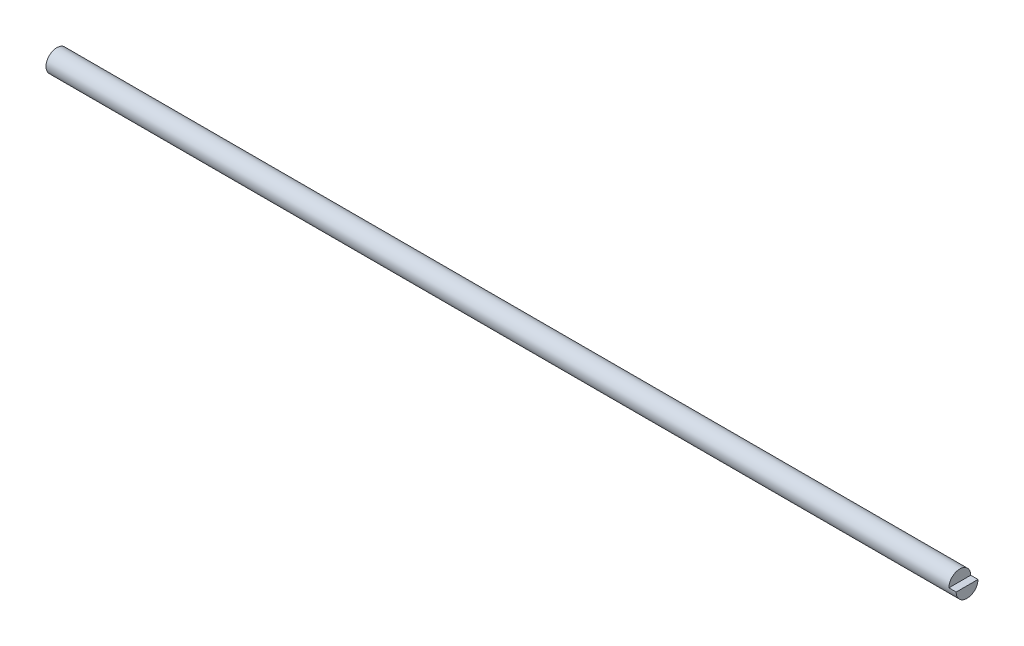
ISO-10303-21;
HEADER;
FILE_DESCRIPTION(('STEP AP214'),'2;1');
FILE_NAME('part.step','',(''),(''),'','','');
FILE_SCHEMA(('AUTOMOTIVE_DESIGN { 1 0 10303 214 1 1 1 1 }'));
ENDSEC;
DATA;
#1=APPLICATION_CONTEXT('core data for automotive mechanical design processes');
#2=APPLICATION_PROTOCOL_DEFINITION('international standard','automotive_design',2000,#1);
#3=PRODUCT_CONTEXT('',#1,'mechanical');
#4=PRODUCT('Part','Part','',(#3));
#5=PRODUCT_RELATED_PRODUCT_CATEGORY('part','',(#4));
#6=PRODUCT_DEFINITION_FORMATION('','',#4);
#7=PRODUCT_DEFINITION_CONTEXT('part definition',#1,'design');
#8=PRODUCT_DEFINITION('design','',#6,#7);
#9=PRODUCT_DEFINITION_SHAPE('','',#8);
#10=(LENGTH_UNIT() NAMED_UNIT(*) SI_UNIT(.MILLI.,.METRE.));
#11=(NAMED_UNIT(*) PLANE_ANGLE_UNIT() SI_UNIT($,.RADIAN.));
#12=(NAMED_UNIT(*) SI_UNIT($,.STERADIAN.) SOLID_ANGLE_UNIT());
#13=UNCERTAINTY_MEASURE_WITH_UNIT(LENGTH_MEASURE(1.E-05),#10,'distance_accuracy_value','');
#14=(GEOMETRIC_REPRESENTATION_CONTEXT(3) GLOBAL_UNCERTAINTY_ASSIGNED_CONTEXT((#13)) GLOBAL_UNIT_ASSIGNED_CONTEXT((#10,
#11,#12)) REPRESENTATION_CONTEXT('',''));
#15=CARTESIAN_POINT('',(0.,0.,0.));
#16=DIRECTION('',(0.,0.,1.));
#17=DIRECTION('',(1.,0.,0.));
#18=AXIS2_PLACEMENT_3D('',#15,#16,#17);
#19=CARTESIAN_POINT('',(317.5,0.,0.));
#20=DIRECTION('',(-1.,0.,0.));
#21=DIRECTION('',(0.,0.,1.));
#22=AXIS2_PLACEMENT_3D('',#19,#20,#21);
#23=CYLINDRICAL_SURFACE('',#22,3.81);
#24=CARTESIAN_POINT('',(0.,0.,0.));
#25=DIRECTION('',(1.,0.,0.));
#26=DIRECTION('',(0.,0.,-1.));
#27=AXIS2_PLACEMENT_3D('',#24,#25,#26);
#28=CIRCLE('',#27,3.81);
#29=CARTESIAN_POINT('',(0.,0.,-3.81));
#30=VERTEX_POINT('',#29);
#31=EDGE_CURVE('E38',#30,#30,#28,.T.);
#32=ORIENTED_EDGE('',*,*,#31,.T.);
#33=EDGE_LOOP('',(#32));
#34=FACE_BOUND('',#33,.T.);
#35=DIRECTION('',(1.,0.,0.));
#36=VECTOR('',#35,1.);
#37=CARTESIAN_POINT('',(314.96,0.,-3.81));
#38=LINE('',#37,#36);
#39=CARTESIAN_POINT('',(314.96,0.,-3.81));
#40=VERTEX_POINT('',#39);
#41=CARTESIAN_POINT('',(317.5,0.,-3.81));
#42=VERTEX_POINT('',#41);
#43=EDGE_CURVE('E62',#40,#42,#38,.T.);
#44=ORIENTED_EDGE('',*,*,#43,.T.);
#45=CARTESIAN_POINT('',(317.5,0.,0.));
#46=DIRECTION('',(1.,0.,0.));
#47=DIRECTION('',(0.,0.,-1.));
#48=AXIS2_PLACEMENT_3D('',#45,#46,#47);
#49=CIRCLE('',#48,3.81);
#50=CARTESIAN_POINT('',(317.5,2.09554595897973E-12,3.81));
#51=VERTEX_POINT('',#50);
#52=EDGE_CURVE('E11',#51,#42,#49,.T.);
#53=ORIENTED_EDGE('',*,*,#52,.F.);
#54=DIRECTION('',(1.,0.,0.));
#55=VECTOR('',#54,1.);
#56=CARTESIAN_POINT('',(314.96,2.09554595897973E-12,3.81));
#57=LINE('',#56,#55);
#58=CARTESIAN_POINT('',(314.96,2.09554595897973E-12,3.81));
#59=VERTEX_POINT('',#58);
#60=EDGE_CURVE('E49',#59,#51,#57,.T.);
#61=ORIENTED_EDGE('',*,*,#60,.F.);
#62=CARTESIAN_POINT('',(314.96,0.,0.));
#63=DIRECTION('',(1.,0.,0.));
#64=DIRECTION('',(0.,0.,-1.));
#65=AXIS2_PLACEMENT_3D('',#62,#63,#64);
#66=CIRCLE('',#65,3.81);
#67=EDGE_CURVE('E68',#40,#59,#66,.T.);
#68=ORIENTED_EDGE('',*,*,#67,.F.);
#69=EDGE_LOOP('',(#44,#53,#61,#68));
#70=FACE_BOUND('',#69,.T.);
#71=ADVANCED_FACE('F35',(#34,#70),#23,.T.);
#72=CARTESIAN_POINT('',(317.5,0.,0.));
#73=DIRECTION('',(1.,0.,0.));
#74=DIRECTION('',(0.,0.,-1.));
#75=AXIS2_PLACEMENT_3D('',#72,#73,#74);
#76=PLANE('',#75);
#77=ORIENTED_EDGE('',*,*,#52,.T.);
#78=DIRECTION('',(0.,5.50012062724339E-13,1.));
#79=VECTOR('',#78,1.);
#80=CARTESIAN_POINT('',(317.5,0.,0.));
#81=LINE('',#80,#79);
#82=EDGE_CURVE('E59',#42,#51,#81,.T.);
#83=ORIENTED_EDGE('',*,*,#82,.T.);
#84=EDGE_LOOP('',(#77,#83));
#85=FACE_BOUND('',#84,.T.);
#86=ADVANCED_FACE('F70',(#85),#76,.T.);
#87=CARTESIAN_POINT('',(0.,0.,0.));
#88=DIRECTION('',(1.,0.,0.));
#89=DIRECTION('',(0.,0.,-1.));
#90=AXIS2_PLACEMENT_3D('',#87,#88,#89);
#91=PLANE('',#90);
#92=ORIENTED_EDGE('',*,*,#31,.F.);
#93=EDGE_LOOP('',(#92));
#94=FACE_BOUND('',#93,.T.);
#95=ADVANCED_FACE('F72',(#94),#91,.F.);
#96=CARTESIAN_POINT('',(314.96,0.,0.));
#97=DIRECTION('',(0.,1.,-5.50012062724339E-13));
#98=DIRECTION('',(0.,5.50012062724339E-13,1.));
#99=AXIS2_PLACEMENT_3D('',#96,#97,#98);
#100=PLANE('',#99);
#101=ORIENTED_EDGE('',*,*,#82,.F.);
#102=ORIENTED_EDGE('',*,*,#43,.F.);
#103=DIRECTION('',(0.,5.50012062724339E-13,1.));
#104=VECTOR('',#103,1.);
#105=CARTESIAN_POINT('',(314.96,0.,0.));
#106=LINE('',#105,#104);
#107=EDGE_CURVE('E55',#40,#59,#106,.T.);
#108=ORIENTED_EDGE('',*,*,#107,.T.);
#109=ORIENTED_EDGE('',*,*,#60,.T.);
#110=EDGE_LOOP('',(#101,#102,#108,#109));
#111=FACE_BOUND('',#110,.T.);
#112=ADVANCED_FACE('F61',(#111),#100,.T.);
#113=CARTESIAN_POINT('',(314.96,0.,0.));
#114=DIRECTION('',(1.,0.,0.));
#115=DIRECTION('',(0.,0.,-1.));
#116=AXIS2_PLACEMENT_3D('',#113,#114,#115);
#117=PLANE('',#116);
#118=ORIENTED_EDGE('',*,*,#107,.F.);
#119=ORIENTED_EDGE('',*,*,#67,.T.);
#120=EDGE_LOOP('',(#118,#119));
#121=FACE_BOUND('',#120,.T.);
#122=ADVANCED_FACE('F83',(#121),#117,.T.);
#123=CLOSED_SHELL('',(#71,#86,#95,#112,#122));
#124=MANIFOLD_SOLID_BREP('B2',#123);
#125=ADVANCED_BREP_SHAPE_REPRESENTATION('',(#18,#124),#14);
#126=SHAPE_DEFINITION_REPRESENTATION(#9,#125);
ENDSEC;
END-ISO-10303-21;
